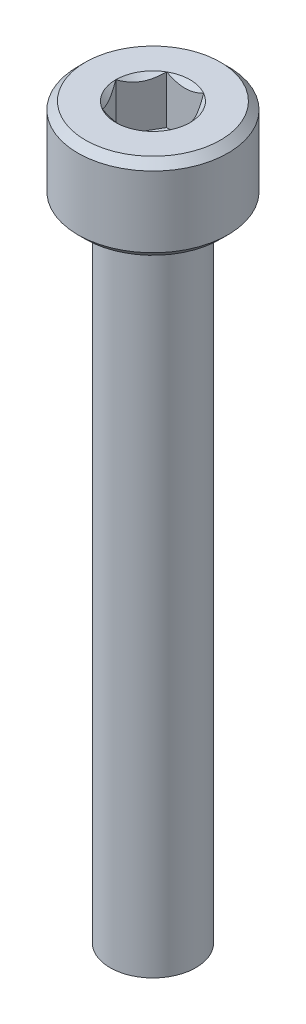
ISO-10303-21;
HEADER;
FILE_DESCRIPTION(('STEP AP214'),'2;1');
FILE_NAME('part.step','',(''),(''),'','','');
FILE_SCHEMA(('AUTOMOTIVE_DESIGN { 1 0 10303 214 1 1 1 1 }'));
ENDSEC;
DATA;
#1=APPLICATION_CONTEXT('core data for automotive mechanical design processes');
#2=APPLICATION_PROTOCOL_DEFINITION('international standard','automotive_design',2000,#1);
#3=PRODUCT_CONTEXT('',#1,'mechanical');
#4=PRODUCT('Part','Part','',(#3));
#5=PRODUCT_RELATED_PRODUCT_CATEGORY('part','',(#4));
#6=PRODUCT_DEFINITION_FORMATION('','',#4);
#7=PRODUCT_DEFINITION_CONTEXT('part definition',#1,'design');
#8=PRODUCT_DEFINITION('design','',#6,#7);
#9=PRODUCT_DEFINITION_SHAPE('','',#8);
#10=(LENGTH_UNIT() NAMED_UNIT(*) SI_UNIT(.MILLI.,.METRE.));
#11=(NAMED_UNIT(*) PLANE_ANGLE_UNIT() SI_UNIT($,.RADIAN.));
#12=(NAMED_UNIT(*) SI_UNIT($,.STERADIAN.) SOLID_ANGLE_UNIT());
#13=UNCERTAINTY_MEASURE_WITH_UNIT(LENGTH_MEASURE(1.E-05),#10,'distance_accuracy_value','');
#14=(GEOMETRIC_REPRESENTATION_CONTEXT(3) GLOBAL_UNCERTAINTY_ASSIGNED_CONTEXT((#13)) GLOBAL_UNIT_ASSIGNED_CONTEXT((#10,
#11,#12)) REPRESENTATION_CONTEXT('',''));
#15=CARTESIAN_POINT('',(0.,0.,0.));
#16=DIRECTION('',(0.,0.,1.));
#17=DIRECTION('',(1.,0.,0.));
#18=AXIS2_PLACEMENT_3D('',#15,#16,#17);
#19=CARTESIAN_POINT('',(0.,4.,0.));
#20=DIRECTION('',(0.,-1.,0.));
#21=DIRECTION('',(0.,0.,-1.));
#22=AXIS2_PLACEMENT_3D('',#19,#20,#21);
#23=CYLINDRICAL_SURFACE('',#22,3.5);
#24=CARTESIAN_POINT('',(0.,0.350000000000001,0.));
#25=DIRECTION('',(0.,1.,0.));
#26=DIRECTION('',(0.,0.,1.));
#27=AXIS2_PLACEMENT_3D('',#24,#25,#26);
#28=CIRCLE('',#27,3.5);
#29=CARTESIAN_POINT('',(0.,0.350000000000001,3.5));
#30=VERTEX_POINT('',#29);
#31=EDGE_CURVE('E227',#30,#30,#28,.T.);
#32=ORIENTED_EDGE('',*,*,#31,.T.);
#33=EDGE_LOOP('',(#32));
#34=FACE_BOUND('',#33,.T.);
#35=CARTESIAN_POINT('',(0.,3.65,0.));
#36=DIRECTION('',(0.,1.,0.));
#37=DIRECTION('',(0.,0.,1.));
#38=AXIS2_PLACEMENT_3D('',#35,#36,#37);
#39=CIRCLE('',#38,3.5);
#40=CARTESIAN_POINT('',(0.,3.65,3.5));
#41=VERTEX_POINT('',#40);
#42=EDGE_CURVE('E104',#41,#41,#39,.F.);
#43=ORIENTED_EDGE('',*,*,#42,.T.);
#44=EDGE_LOOP('',(#43));
#45=FACE_BOUND('',#44,.T.);
#46=ADVANCED_FACE('F32',(#34,#45),#23,.T.);
#47=CARTESIAN_POINT('',(0.,4.,0.));
#48=DIRECTION('',(0.,1.,0.));
#49=DIRECTION('',(0.,0.,1.));
#50=AXIS2_PLACEMENT_3D('',#47,#48,#49);
#51=PLANE('',#50);
#52=CARTESIAN_POINT('',(0.,4.,0.));
#53=DIRECTION('',(0.,1.,0.));
#54=DIRECTION('',(0.,0.,1.));
#55=AXIS2_PLACEMENT_3D('',#52,#53,#54);
#56=CIRCLE('',#55,3.15);
#57=CARTESIAN_POINT('',(0.,4.,3.15));
#58=VERTEX_POINT('',#57);
#59=EDGE_CURVE('E36',#58,#58,#56,.T.);
#60=ORIENTED_EDGE('',*,*,#59,.T.);
#61=EDGE_LOOP('',(#60));
#62=FACE_BOUND('',#61,.T.);
#63=CARTESIAN_POINT('',(0.,4.,0.));
#64=DIRECTION('',(0.,1.,0.));
#65=DIRECTION('',(0.,0.,1.));
#66=AXIS2_PLACEMENT_3D('',#63,#64,#65);
#67=CIRCLE('',#66,1.73205080756888);
#68=CARTESIAN_POINT('',(0.866025403784438,4.,1.5));
#69=VERTEX_POINT('',#68);
#70=CARTESIAN_POINT('',(1.73205080756888,4.,0.));
#71=VERTEX_POINT('',#70);
#72=EDGE_CURVE('E47',#69,#71,#67,.T.);
#73=ORIENTED_EDGE('',*,*,#72,.F.);
#74=CARTESIAN_POINT('',(-0.866025403784438,4.,1.5));
#75=VERTEX_POINT('',#74);
#76=EDGE_CURVE('E54',#75,#69,#67,.T.);
#77=ORIENTED_EDGE('',*,*,#76,.F.);
#78=CARTESIAN_POINT('',(-1.73205080756888,4.,0.));
#79=VERTEX_POINT('',#78);
#80=EDGE_CURVE('E127',#79,#75,#67,.T.);
#81=ORIENTED_EDGE('',*,*,#80,.F.);
#82=CARTESIAN_POINT('',(-0.866025403784439,4.,-1.5));
#83=VERTEX_POINT('',#82);
#84=EDGE_CURVE('E126',#83,#79,#67,.T.);
#85=ORIENTED_EDGE('',*,*,#84,.F.);
#86=CARTESIAN_POINT('',(0.866025403784438,4.,-1.5));
#87=VERTEX_POINT('',#86);
#88=EDGE_CURVE('E94',#87,#83,#67,.T.);
#89=ORIENTED_EDGE('',*,*,#88,.F.);
#90=EDGE_CURVE('E86',#71,#87,#67,.T.);
#91=ORIENTED_EDGE('',*,*,#90,.F.);
#92=EDGE_LOOP('',(#73,#77,#81,#85,#89,#91));
#93=FACE_BOUND('',#92,.T.);
#94=ADVANCED_FACE('F124',(#62,#93),#51,.T.);
#95=CARTESIAN_POINT('',(0.,0.,0.));
#96=DIRECTION('',(0.,1.,0.));
#97=DIRECTION('',(0.,0.,1.));
#98=AXIS2_PLACEMENT_3D('',#95,#96,#97);
#99=PLANE('',#98);
#100=CARTESIAN_POINT('',(0.,0.,0.));
#101=DIRECTION('',(0.,-1.,0.));
#102=DIRECTION('',(0.,0.,-1.));
#103=AXIS2_PLACEMENT_3D('',#100,#101,#102);
#104=CIRCLE('',#103,2.);
#105=CARTESIAN_POINT('',(0.,0.,-2.));
#106=VERTEX_POINT('',#105);
#107=EDGE_CURVE('E11',#106,#106,#104,.T.);
#108=ORIENTED_EDGE('',*,*,#107,.F.);
#109=EDGE_LOOP('',(#108));
#110=FACE_BOUND('',#109,.T.);
#111=CARTESIAN_POINT('',(0.,0.,0.));
#112=DIRECTION('',(0.,1.,0.));
#113=DIRECTION('',(0.,0.,1.));
#114=AXIS2_PLACEMENT_3D('',#111,#112,#113);
#115=CIRCLE('',#114,3.15);
#116=CARTESIAN_POINT('',(0.,0.,3.15));
#117=VERTEX_POINT('',#116);
#118=EDGE_CURVE('E225',#117,#117,#115,.F.);
#119=ORIENTED_EDGE('',*,*,#118,.T.);
#120=EDGE_LOOP('',(#119));
#121=FACE_BOUND('',#120,.T.);
#122=ADVANCED_FACE('F208',(#110,#121),#99,.F.);
#123=CARTESIAN_POINT('',(0.,4.,0.));
#124=DIRECTION('',(0.,1.,0.));
#125=DIRECTION('',(0.,0.,1.));
#126=AXIS2_PLACEMENT_3D('',#123,#124,#125);
#127=CONICAL_SURFACE('',#126,1.73205080756888,0.78539816339745);
#128=ORIENTED_EDGE('',*,*,#88,.T.);
#129=CARTESIAN_POINT('',(-1.72720812969692,4.55557851627079,-1.5));
#130=CARTESIAN_POINT('',(-1.68515175699268,4.52382990785743,-1.5));
#131=CARTESIAN_POINT('',(-1.64286104748673,4.49239259380738,-1.5));
#132=CARTESIAN_POINT('',(-1.55771581035942,4.43026908755641,-1.5));
#133=CARTESIAN_POINT('',(-1.51486114386668,4.3995830858922,-1.5));
#134=CARTESIAN_POINT('',(-1.3846813415127,4.30840719242716,-1.5));
#135=CARTESIAN_POINT('',(-1.29637976071654,4.24928834342677,-1.5));
#136=CARTESIAN_POINT('',(-1.11121478730467,4.1332309963165,-1.5));
#137=CARTESIAN_POINT('',(-1.01415038238167,4.07660955873301,-1.5));
#138=CARTESIAN_POINT('',(-0.815173408897606,3.97303688126565,-1.5));
#139=CARTESIAN_POINT('',(-0.713278669253285,3.92605304154167,-1.5));
#140=CARTESIAN_POINT('',(-0.560333774943112,3.86857266843083,-1.5));
#141=CARTESIAN_POINT('',(-0.511547982948042,3.85207538775725,-1.5));
#142=CARTESIAN_POINT('',(-0.412798620136866,3.822997512927,-1.5));
#143=CARTESIAN_POINT('',(-0.362834968437563,3.81041718859402,-1.5));
#144=CARTESIAN_POINT('',(-0.262863235444982,3.79003619414677,-1.5));
#145=CARTESIAN_POINT('',(-0.212872113808023,3.78215363274598,-1.5));
#146=CARTESIAN_POINT('',(-0.112355243569545,3.771322063969,-1.5));
#147=CARTESIAN_POINT('',(-0.0618295883726279,3.76837220852435,-1.5));
#148=CARTESIAN_POINT('',(0.037429173332384,3.76762485772485,-1.5));
#149=CARTESIAN_POINT('',(0.0861609672002989,3.76964473355808,-1.5));
#150=CARTESIAN_POINT('',(0.183206937768827,3.77832255289676,-1.5));
#151=CARTESIAN_POINT('',(0.231521073438269,3.78498094696846,-1.5));
#152=CARTESIAN_POINT('',(0.328199853425436,3.80268524412257,-1.5));
#153=CARTESIAN_POINT('',(0.376550616310328,3.81380581125704,-1.5));
#154=CARTESIAN_POINT('',(0.472195697125598,3.83984341404871,-1.5));
#155=CARTESIAN_POINT('',(0.51949010309274,3.85476013204094,-1.5));
#156=CARTESIAN_POINT('',(0.668391282696624,3.90733522359607,-1.5));
#157=CARTESIAN_POINT('',(0.767878709508552,3.95098128747198,-1.5));
#158=CARTESIAN_POINT('',(0.962179866690724,4.0480229945931,-1.5));
#159=CARTESIAN_POINT('',(1.05697519961444,4.10145366508953,-1.5));
#160=CARTESIAN_POINT('',(1.23814273533383,4.21168585200456,-1.5));
#161=CARTESIAN_POINT('',(1.3246994218129,4.2681879206986,-1.5));
#162=CARTESIAN_POINT('',(1.45222331290673,4.35553430157866,-1.5));
#163=CARTESIAN_POINT('',(1.49418091978756,4.38495775868004,-1.5));
#164=CARTESIAN_POINT('',(1.57752272931476,4.44458282183046,-1.5));
#165=CARTESIAN_POINT('',(1.61890708647354,4.47478421166444,-1.5));
#166=CARTESIAN_POINT('',(1.66005278019494,4.50530817860946,-1.5));
#167=B_SPLINE_CURVE_WITH_KNOTS('',3,(#129,#130,#131,#132,#133,#134,#135,#136,#137,#138,#139,
#140,#141,#142,#143,#144,#145,#146,#147,#148,#149,#150,#151,#152,#153,#154,#155,#156,#157,#158,
#159,#160,#161,#162,#163,#164,#165,#166),.UNSPECIFIED.,.F.,.F.,(4,2,2,2,2,2,2,2,2,2,2,2,2,2,2,2,
2,2,4),(0.,0.158079548982669,0.316198780993942,0.634850417346958,0.971690311361509,
1.30737131660667,1.46173961127089,1.61611853740677,1.76772101421409,1.91929742368538,
2.065387412096,2.21149159305544,2.36014984633872,2.50879566386709,2.83376031422673,
3.15991186985652,3.46985601802197,3.62358896039974,3.7772796264207),.UNSPECIFIED.);
#168=EDGE_CURVE('E99',#87,#83,#167,.F.);
#169=ORIENTED_EDGE('',*,*,#168,.F.);
#170=EDGE_LOOP('',(#128,#169));
#171=FACE_BOUND('',#170,.T.);
#172=ADVANCED_FACE('F100',(#171),#127,.F.);
#173=ORIENTED_EDGE('',*,*,#84,.T.);
#174=CARTESIAN_POINT('',(-0.865909933730601,4.00011548160007,-1.5002));
#175=CARTESIAN_POINT('',(-0.895682611594166,3.97036547606733,-1.44863220926292));
#176=CARTESIAN_POINT('',(-0.925953159489765,3.94236248391031,-1.3962020823348));
#177=CARTESIAN_POINT('',(-0.987678321317123,3.89108923044014,-1.2892909659444));
#178=CARTESIAN_POINT('',(-1.01913880822717,3.86784750504437,-1.23479980418534));
#179=CARTESIAN_POINT('',(-1.08257741237344,3.82803372899222,-1.12492091864275));
#180=CARTESIAN_POINT('',(-1.11453936608521,3.8113615856709,-1.0695611909048));
#181=CARTESIAN_POINT('',(-1.1791670593912,3.7856744568181,-0.957622742522849));
#182=CARTESIAN_POINT('',(-1.21183082354213,3.77664029047887,-0.901047443446992));
#183=CARTESIAN_POINT('',(-1.26812411040032,3.76848908122685,-0.803544610483559));
#184=CARTESIAN_POINT('',(-1.29168087824208,3.76728225298922,-0.762743091719534));
#185=CARTESIAN_POINT('',(-1.33875285845138,3.76931405716227,-0.681212030384142));
#186=CARTESIAN_POINT('',(-1.36226806050018,3.77255367074831,-0.64048250568537));
#187=CARTESIAN_POINT('',(-1.40907206156905,3.78329198598196,-0.559415597836584));
#188=CARTESIAN_POINT('',(-1.43236062923612,3.79079465301873,-0.519078615401712));
#189=CARTESIAN_POINT('',(-1.47854689118996,3.80965161192829,-0.439081663085969));
#190=CARTESIAN_POINT('',(-1.50144441326545,3.82100755701858,-0.399421991483792));
#191=CARTESIAN_POINT('',(-1.56009461325633,3.85472164759267,-0.297836865225515));
#192=CARTESIAN_POINT('',(-1.59548353987866,3.87962184909337,-0.236541446290311));
#193=CARTESIAN_POINT('',(-1.64751843074894,3.92165665327158,-0.146414371536686));
#194=CARTESIAN_POINT('',(-1.66466545167617,3.9364251535591,-0.116714860092282));
#195=CARTESIAN_POINT('',(-1.69864410935691,3.96731056594017,-0.0578620986162487));
#196=CARTESIAN_POINT('',(-1.71547589206761,3.98342683412171,-0.0287085957793624));
#197=CARTESIAN_POINT('',(-1.73216627762272,4.00011548160007,0.00020000000000028));
#198=B_SPLINE_CURVE_WITH_KNOTS('',3,(#174,#175,#176,#177,#178,#179,#180,#181,#182,#183,#184,
#185,#186,#187,#188,#189,#190,#191,#192,#193,#194,#195,#196,#197),.UNSPECIFIED.,.F.,.F.,(4,2,2,
2,2,2,2,2,2,2,2,4),(0.,0.199829143693304,0.400822987382388,0.598623720538181,0.795926240188889,
0.937113067959881,1.07833105577193,1.21968061668222,1.36109089931054,1.58570969637565,
1.69770705470964,1.80965120737194),.UNSPECIFIED.);
#199=EDGE_CURVE('E129',#83,#79,#198,.T.);
#200=ORIENTED_EDGE('',*,*,#199,.F.);
#201=EDGE_LOOP('',(#173,#200));
#202=FACE_BOUND('',#201,.T.);
#203=ADVANCED_FACE('F240',(#202),#127,.F.);
#204=ORIENTED_EDGE('',*,*,#80,.T.);
#205=CARTESIAN_POINT('',(-1.73216627762272,4.00011548160007,-0.000199999999999694));
#206=CARTESIAN_POINT('',(-1.70239359975915,3.97036547606733,0.051367790737076));
#207=CARTESIAN_POINT('',(-1.67212305186355,3.94236248391031,0.103797917665201));
#208=CARTESIAN_POINT('',(-1.61039789003619,3.89108923044014,0.210709034055597));
#209=CARTESIAN_POINT('',(-1.57893740312614,3.86784750504437,0.265200195814662));
#210=CARTESIAN_POINT('',(-1.51549879897987,3.82803372899222,0.375079081357249));
#211=CARTESIAN_POINT('',(-1.4835368452681,3.8113615856709,0.4304388090952));
#212=CARTESIAN_POINT('',(-1.41890915196211,3.7856744568181,0.542377257477151));
#213=CARTESIAN_POINT('',(-1.38624538781118,3.77664029047887,0.598952556553009));
#214=CARTESIAN_POINT('',(-1.32995210095299,3.76848908122685,0.696455389516441));
#215=CARTESIAN_POINT('',(-1.30639533311124,3.76728225298922,0.737256908280466));
#216=CARTESIAN_POINT('',(-1.25932335290193,3.76931405716227,0.818787969615858));
#217=CARTESIAN_POINT('',(-1.23580815085313,3.77255367074831,0.85951749431463));
#218=CARTESIAN_POINT('',(-1.18900414978427,3.78329198598196,0.940584402163416));
#219=CARTESIAN_POINT('',(-1.1657155821172,3.79079465301873,0.980921384598288));
#220=CARTESIAN_POINT('',(-1.11952932016335,3.80965161192829,1.06091833691403));
#221=CARTESIAN_POINT('',(-1.09663179808786,3.82100755701859,1.10057800851621));
#222=CARTESIAN_POINT('',(-1.03798159809698,3.85472164759267,1.20216313477448));
#223=CARTESIAN_POINT('',(-1.00259267147465,3.87962184909337,1.26345855370969));
#224=CARTESIAN_POINT('',(-0.950557780604375,3.92165665327158,1.35358562846331));
#225=CARTESIAN_POINT('',(-0.933410759677147,3.9364251535591,1.38328513990772));
#226=CARTESIAN_POINT('',(-0.899432101996407,3.96731056594017,1.44213790138375));
#227=CARTESIAN_POINT('',(-0.88260031928571,3.98342683412171,1.47129140422064));
#228=CARTESIAN_POINT('',(-0.865909933730601,4.00011548160007,1.5002));
#229=B_SPLINE_CURVE_WITH_KNOTS('',3,(#205,#206,#207,#208,#209,#210,#211,#212,#213,#214,#215,
#216,#217,#218,#219,#220,#221,#222,#223,#224,#225,#226,#227,#228),.UNSPECIFIED.,.F.,.F.,(4,2,2,
2,2,2,2,2,2,2,2,4),(0.,0.199829143693305,0.400822987382389,0.598623720538181,0.795926240188889,
0.937113067959881,1.07833105577193,1.21968061668222,1.36109089931054,1.58570969637565,
1.69770705470964,1.80965120737194),.UNSPECIFIED.);
#230=EDGE_CURVE('E139',#79,#75,#229,.T.);
#231=ORIENTED_EDGE('',*,*,#230,.F.);
#232=EDGE_LOOP('',(#204,#231));
#233=FACE_BOUND('',#232,.T.);
#234=ADVANCED_FACE('F256',(#233),#127,.F.);
#235=ORIENTED_EDGE('',*,*,#76,.T.);
#236=CARTESIAN_POINT('',(-1.72720812994822,4.55557851646053,1.5));
#237=CARTESIAN_POINT('',(-1.68515175723693,4.52382990803985,1.5));
#238=CARTESIAN_POINT('',(-1.64286104772391,4.49239259398251,1.5));
#239=CARTESIAN_POINT('',(-1.55771581058238,4.43026908771699,1.5));
#240=CARTESIAN_POINT('',(-1.51486114408249,4.39958308604553,1.5));
#241=CARTESIAN_POINT('',(-1.38468134170665,4.30840719255859,1.5));
#242=CARTESIAN_POINT('',(-1.29637976089561,4.24928834354366,1.5));
#243=CARTESIAN_POINT('',(-1.11121478745132,4.13323099640349,1.5));
#244=CARTESIAN_POINT('',(-1.01415038251067,4.07660955880473,1.5));
#245=CARTESIAN_POINT('',(-0.815173408989814,3.9730368813091,1.5));
#246=CARTESIAN_POINT('',(-0.71327866932636,3.92605304157206,1.5));
#247=CARTESIAN_POINT('',(-0.56033377500179,3.86857266845154,1.5));
#248=CARTESIAN_POINT('',(-0.511547983012749,3.85207538777834,1.5));
#249=CARTESIAN_POINT('',(-0.412798620213828,3.82299751294763,1.5));
#250=CARTESIAN_POINT('',(-0.362834968520751,3.8104171886138,1.5));
#251=CARTESIAN_POINT('',(-0.262863235540417,3.79003619416346,1.5));
#252=CARTESIAN_POINT('',(-0.212872113909475,3.78215363276045,1.5));
#253=CARTESIAN_POINT('',(-0.112355243682832,3.77132206397768,1.5));
#254=CARTESIAN_POINT('',(-0.061829588491731,3.76837220852945,1.5));
#255=CARTESIAN_POINT('',(0.0374291732025493,3.76762485772178,1.5));
#256=CARTESIAN_POINT('',(0.086160967065534,3.76964473355048,1.5));
#257=CARTESIAN_POINT('',(0.183206937624695,3.77832255287941,1.5));
#258=CARTESIAN_POINT('',(0.2315210732897,3.78498094694588,1.5));
#259=CARTESIAN_POINT('',(0.328199853268108,3.80268524408904,1.5));
#260=CARTESIAN_POINT('',(0.376550616148692,3.81380581121775,1.5));
#261=CARTESIAN_POINT('',(0.47219569695576,3.83984341399777,1.5));
#262=CARTESIAN_POINT('',(0.51949010291901,3.8547601319841,1.5));
#263=CARTESIAN_POINT('',(0.668391282485064,3.90733522351148,1.5));
#264=CARTESIAN_POINT('',(0.767878709264951,3.95098128736184,1.5));
#265=CARTESIAN_POINT('',(0.9621798663855,4.04802299442906,1.5));
#266=CARTESIAN_POINT('',(1.05697519927965,4.10145366489712,1.5));
#267=CARTESIAN_POINT('',(1.23814273494588,4.21168585175783,1.5));
#268=CARTESIAN_POINT('',(1.32469942140117,4.26818792042618,1.5));
#269=CARTESIAN_POINT('',(1.45222331245985,4.35553430126784,1.5));
#270=CARTESIAN_POINT('',(1.49418091932912,4.38495775835653,1.5));
#271=CARTESIAN_POINT('',(1.5775227288333,4.44458282148157,1.5));
#272=CARTESIAN_POINT('',(1.6189070859806,4.47478421130286,1.5));
#273=CARTESIAN_POINT('',(1.66005277969054,4.50530817823521,1.5));
#274=B_SPLINE_CURVE_WITH_KNOTS('',3,(#236,#237,#238,#239,#240,#241,#242,#243,#244,#245,#246,
#247,#248,#249,#250,#251,#252,#253,#254,#255,#256,#257,#258,#259,#260,#261,#262,#263,#264,#265,
#266,#267,#268,#269,#270,#271,#272,#273),.UNSPECIFIED.,.F.,.F.,(4,2,2,2,2,2,2,2,2,2,2,2,2,2,2,2,
2,2,4),(0.,0.158079549012757,0.316198781054129,0.634850417468465,0.971690311551782,
1.30737131686505,1.46173961151184,1.61611853763032,1.76772101442095,1.91929742387554,
2.06538741227089,2.21149159321503,2.36014984648185,2.50879566399376,2.83376031423511,
3.15991186974582,3.4698560178094,3.62358896013692,3.77727962610764),.UNSPECIFIED.);
#275=EDGE_CURVE('E168',#75,#69,#274,.T.);
#276=ORIENTED_EDGE('',*,*,#275,.F.);
#277=EDGE_LOOP('',(#235,#276));
#278=FACE_BOUND('',#277,.T.);
#279=ADVANCED_FACE('F286',(#278),#127,.F.);
#280=ORIENTED_EDGE('',*,*,#72,.T.);
#281=CARTESIAN_POINT('',(0.865909933730601,4.00011548160007,1.5002));
#282=CARTESIAN_POINT('',(0.895682611594166,3.97036547606733,1.44863220926292));
#283=CARTESIAN_POINT('',(0.925953159489765,3.94236248391031,1.3962020823348));
#284=CARTESIAN_POINT('',(0.987678321317124,3.89108923044014,1.2892909659444));
#285=CARTESIAN_POINT('',(1.01913880822717,3.86784750504437,1.23479980418534));
#286=CARTESIAN_POINT('',(1.08257741237344,3.82803372899222,1.12492091864275));
#287=CARTESIAN_POINT('',(1.11453936608521,3.8113615856709,1.0695611909048));
#288=CARTESIAN_POINT('',(1.1791670593912,3.7856744568181,0.95762274252285));
#289=CARTESIAN_POINT('',(1.21183082354213,3.77664029047887,0.901047443446992));
#290=CARTESIAN_POINT('',(1.26812411040032,3.76848908122685,0.80354461048356));
#291=CARTESIAN_POINT('',(1.29168087824208,3.76728225298922,0.762743091719534));
#292=CARTESIAN_POINT('',(1.33875285845138,3.76931405716227,0.681212030384142));
#293=CARTESIAN_POINT('',(1.36226806050018,3.77255367074831,0.640482505685371));
#294=CARTESIAN_POINT('',(1.40907206156905,3.78329198598196,0.559415597836584));
#295=CARTESIAN_POINT('',(1.43236062923612,3.79079465301873,0.519078615401712));
#296=CARTESIAN_POINT('',(1.47854689118996,3.80965161192829,0.43908166308597));
#297=CARTESIAN_POINT('',(1.50144441326545,3.82100755701859,0.399421991483792));
#298=CARTESIAN_POINT('',(1.56009461325633,3.85472164759267,0.297836865225515));
#299=CARTESIAN_POINT('',(1.59548353987866,3.87962184909337,0.236541446290311));
#300=CARTESIAN_POINT('',(1.64751843074894,3.92165665327158,0.146414371536686));
#301=CARTESIAN_POINT('',(1.66466545167617,3.9364251535591,0.116714860092282));
#302=CARTESIAN_POINT('',(1.69864410935691,3.96731056594017,0.0578620986162488));
#303=CARTESIAN_POINT('',(1.71547589206761,3.98342683412171,0.0287085957793626));
#304=CARTESIAN_POINT('',(1.73216627762272,4.00011548160007,-0.000200000000000026));
#305=B_SPLINE_CURVE_WITH_KNOTS('',3,(#281,#282,#283,#284,#285,#286,#287,#288,#289,#290,#291,
#292,#293,#294,#295,#296,#297,#298,#299,#300,#301,#302,#303,#304),.UNSPECIFIED.,.F.,.F.,(4,2,2,
2,2,2,2,2,2,2,2,4),(0.,0.199829143693305,0.400822987382389,0.59862372053818,0.795926240188889,
0.937113067959881,1.07833105577193,1.21968061668222,1.36109089931054,1.58570969637565,
1.69770705470964,1.80965120737194),.UNSPECIFIED.);
#306=EDGE_CURVE('E114',#69,#71,#305,.T.);
#307=ORIENTED_EDGE('',*,*,#306,.F.);
#308=EDGE_LOOP('',(#280,#307));
#309=FACE_BOUND('',#308,.T.);
#310=ADVANCED_FACE('F154',(#309),#127,.F.);
#311=ORIENTED_EDGE('',*,*,#90,.T.);
#312=CARTESIAN_POINT('',(1.73216627762272,4.00011548160007,0.000200000000000282));
#313=CARTESIAN_POINT('',(1.70239359975915,3.97036547606733,-0.0513677907370753));
#314=CARTESIAN_POINT('',(1.67212305186355,3.94236248391031,-0.103797917665201));
#315=CARTESIAN_POINT('',(1.61039789003619,3.89108923044014,-0.210709034055596));
#316=CARTESIAN_POINT('',(1.57893740312614,3.86784750504437,-0.265200195814661));
#317=CARTESIAN_POINT('',(1.51549879897987,3.82803372899222,-0.375079081357248));
#318=CARTESIAN_POINT('',(1.4835368452681,3.8113615856709,-0.430438809095199));
#319=CARTESIAN_POINT('',(1.41890915196211,3.7856744568181,-0.54237725747715));
#320=CARTESIAN_POINT('',(1.38624538781118,3.77664029047887,-0.598952556553008));
#321=CARTESIAN_POINT('',(1.32995210095299,3.76848908122685,-0.69645538951644));
#322=CARTESIAN_POINT('',(1.30639533311124,3.76728225298922,-0.737256908280466));
#323=CARTESIAN_POINT('',(1.25932335290193,3.76931405716227,-0.818787969615858));
#324=CARTESIAN_POINT('',(1.23580815085313,3.77255367074831,-0.85951749431463));
#325=CARTESIAN_POINT('',(1.18900414978427,3.78329198598196,-0.940584402163416));
#326=CARTESIAN_POINT('',(1.1657155821172,3.79079465301873,-0.980921384598288));
#327=CARTESIAN_POINT('',(1.11952932016335,3.80965161192829,-1.06091833691403));
#328=CARTESIAN_POINT('',(1.09663179808786,3.82100755701858,-1.10057800851621));
#329=CARTESIAN_POINT('',(1.03798159809698,3.85472164759267,-1.20216313477448));
#330=CARTESIAN_POINT('',(1.00259267147465,3.87962184909337,-1.26345855370969));
#331=CARTESIAN_POINT('',(0.950557780604375,3.92165665327158,-1.35358562846331));
#332=CARTESIAN_POINT('',(0.933410759677148,3.9364251535591,-1.38328513990772));
#333=CARTESIAN_POINT('',(0.899432101996407,3.96731056594017,-1.44213790138375));
#334=CARTESIAN_POINT('',(0.88260031928571,3.98342683412171,-1.47129140422064));
#335=CARTESIAN_POINT('',(0.865909933730601,4.00011548160007,-1.5002));
#336=B_SPLINE_CURVE_WITH_KNOTS('',3,(#312,#313,#314,#315,#316,#317,#318,#319,#320,#321,#322,
#323,#324,#325,#326,#327,#328,#329,#330,#331,#332,#333,#334,#335),.UNSPECIFIED.,.F.,.F.,(4,2,2,
2,2,2,2,2,2,2,2,4),(0.,0.199829143693305,0.400822987382389,0.598623720538181,0.79592624018889,
0.937113067959881,1.07833105577193,1.21968061668222,1.36109089931054,1.58570969637566,
1.69770705470964,1.80965120737194),.UNSPECIFIED.);
#337=EDGE_CURVE('E90',#71,#87,#336,.T.);
#338=ORIENTED_EDGE('',*,*,#337,.F.);
#339=EDGE_LOOP('',(#311,#338));
#340=FACE_BOUND('',#339,.T.);
#341=ADVANCED_FACE('F88',(#340),#127,.F.);
#342=CARTESIAN_POINT('',(0.,1.75,0.));
#343=DIRECTION('',(0.,1.,0.));
#344=DIRECTION('',(0.,0.,1.));
#345=AXIS2_PLACEMENT_3D('',#342,#343,#344);
#346=PLANE('',#345);
#347=DIRECTION('',(-0.5,0.,-0.866025403784439));
#348=VECTOR('',#347,1.);
#349=CARTESIAN_POINT('',(1.73205080756888,1.75,0.));
#350=LINE('',#349,#348);
#351=CARTESIAN_POINT('',(1.73205080756888,1.75,0.));
#352=VERTEX_POINT('',#351);
#353=CARTESIAN_POINT('',(0.866025403784438,1.75,-1.5));
#354=VERTEX_POINT('',#353);
#355=EDGE_CURVE('E113',#352,#354,#350,.T.);
#356=ORIENTED_EDGE('',*,*,#355,.T.);
#357=DIRECTION('',(-1.,0.,0.));
#358=VECTOR('',#357,1.);
#359=CARTESIAN_POINT('',(0.866025403784438,1.75,-1.5));
#360=LINE('',#359,#358);
#361=CARTESIAN_POINT('',(-0.866025403784439,1.75,-1.5));
#362=VERTEX_POINT('',#361);
#363=EDGE_CURVE('E118',#354,#362,#360,.T.);
#364=ORIENTED_EDGE('',*,*,#363,.T.);
#365=DIRECTION('',(-0.5,0.,0.866025403784439));
#366=VECTOR('',#365,1.);
#367=CARTESIAN_POINT('',(-0.866025403784439,1.75,-1.5));
#368=LINE('',#367,#366);
#369=CARTESIAN_POINT('',(-1.73205080756888,1.75,0.));
#370=VERTEX_POINT('',#369);
#371=EDGE_CURVE('E280',#362,#370,#368,.T.);
#372=ORIENTED_EDGE('',*,*,#371,.T.);
#373=DIRECTION('',(0.5,0.,0.866025403784439));
#374=VECTOR('',#373,1.);
#375=CARTESIAN_POINT('',(-1.73205080756888,1.75,0.));
#376=LINE('',#375,#374);
#377=CARTESIAN_POINT('',(-0.866025403784438,1.75,1.5));
#378=VERTEX_POINT('',#377);
#379=EDGE_CURVE('E263',#370,#378,#376,.T.);
#380=ORIENTED_EDGE('',*,*,#379,.T.);
#381=DIRECTION('',(1.,0.,0.));
#382=VECTOR('',#381,1.);
#383=CARTESIAN_POINT('',(-0.866025403784438,1.75,1.5));
#384=LINE('',#383,#382);
#385=CARTESIAN_POINT('',(0.866025403784439,1.75,1.5));
#386=VERTEX_POINT('',#385);
#387=EDGE_CURVE('E276',#378,#386,#384,.T.);
#388=ORIENTED_EDGE('',*,*,#387,.T.);
#389=DIRECTION('',(0.5,0.,-0.866025403784439));
#390=VECTOR('',#389,1.);
#391=CARTESIAN_POINT('',(0.866025403784439,1.75,1.5));
#392=LINE('',#391,#390);
#393=EDGE_CURVE('E121',#386,#352,#392,.T.);
#394=ORIENTED_EDGE('',*,*,#393,.T.);
#395=EDGE_LOOP('',(#356,#364,#372,#380,#388,#394));
#396=FACE_BOUND('',#395,.T.);
#397=ADVANCED_FACE('F153',(#396),#346,.T.);
#398=CARTESIAN_POINT('',(0.866025403784438,1.75,-1.5));
#399=DIRECTION('',(0.,0.,-1.));
#400=DIRECTION('',(-1.,0.,0.));
#401=AXIS2_PLACEMENT_3D('',#398,#399,#400);
#402=PLANE('',#401);
#403=DIRECTION('',(0.,1.,0.));
#404=VECTOR('',#403,1.);
#405=CARTESIAN_POINT('',(0.866025403784438,1.75,-1.5));
#406=LINE('',#405,#404);
#407=EDGE_CURVE('E111',#354,#87,#406,.T.);
#408=ORIENTED_EDGE('',*,*,#407,.T.);
#409=ORIENTED_EDGE('',*,*,#168,.T.);
#410=DIRECTION('',(0.,1.,0.));
#411=VECTOR('',#410,1.);
#412=CARTESIAN_POINT('',(-0.866025403784439,1.75,-1.5));
#413=LINE('',#412,#411);
#414=EDGE_CURVE('E120',#362,#83,#413,.T.);
#415=ORIENTED_EDGE('',*,*,#414,.F.);
#416=ORIENTED_EDGE('',*,*,#363,.F.);
#417=EDGE_LOOP('',(#408,#409,#415,#416));
#418=FACE_BOUND('',#417,.T.);
#419=ADVANCED_FACE('F116',(#418),#402,.F.);
#420=CARTESIAN_POINT('',(-0.866025403784439,1.75,-1.5));
#421=DIRECTION('',(-0.866025403784439,0.,-0.5));
#422=DIRECTION('',(-0.5,0.,0.866025403784439));
#423=AXIS2_PLACEMENT_3D('',#420,#421,#422);
#424=PLANE('',#423);
#425=ORIENTED_EDGE('',*,*,#414,.T.);
#426=ORIENTED_EDGE('',*,*,#199,.T.);
#427=DIRECTION('',(0.,1.,0.));
#428=VECTOR('',#427,1.);
#429=CARTESIAN_POINT('',(-1.73205080756888,1.75,0.));
#430=LINE('',#429,#428);
#431=EDGE_CURVE('E259',#370,#79,#430,.T.);
#432=ORIENTED_EDGE('',*,*,#431,.F.);
#433=ORIENTED_EDGE('',*,*,#371,.F.);
#434=EDGE_LOOP('',(#425,#426,#432,#433));
#435=FACE_BOUND('',#434,.T.);
#436=ADVANCED_FACE('F146',(#435),#424,.F.);
#437=CARTESIAN_POINT('',(-1.73205080756888,1.75,0.));
#438=DIRECTION('',(-0.866025403784439,0.,0.5));
#439=DIRECTION('',(0.5,0.,0.866025403784439));
#440=AXIS2_PLACEMENT_3D('',#437,#438,#439);
#441=PLANE('',#440);
#442=ORIENTED_EDGE('',*,*,#431,.T.);
#443=ORIENTED_EDGE('',*,*,#230,.T.);
#444=DIRECTION('',(0.,1.,0.));
#445=VECTOR('',#444,1.);
#446=CARTESIAN_POINT('',(-0.866025403784438,1.75,1.5));
#447=LINE('',#446,#445);
#448=EDGE_CURVE('E265',#378,#75,#447,.T.);
#449=ORIENTED_EDGE('',*,*,#448,.F.);
#450=ORIENTED_EDGE('',*,*,#379,.F.);
#451=EDGE_LOOP('',(#442,#443,#449,#450));
#452=FACE_BOUND('',#451,.T.);
#453=ADVANCED_FACE('F192',(#452),#441,.F.);
#454=CARTESIAN_POINT('',(-0.866025403784438,1.75,1.5));
#455=DIRECTION('',(0.,0.,1.));
#456=DIRECTION('',(1.,0.,0.));
#457=AXIS2_PLACEMENT_3D('',#454,#455,#456);
#458=PLANE('',#457);
#459=ORIENTED_EDGE('',*,*,#448,.T.);
#460=ORIENTED_EDGE('',*,*,#275,.T.);
#461=DIRECTION('',(0.,1.,0.));
#462=VECTOR('',#461,1.);
#463=CARTESIAN_POINT('',(0.866025403784439,1.75,1.5));
#464=LINE('',#463,#462);
#465=EDGE_CURVE('E267',#386,#69,#464,.T.);
#466=ORIENTED_EDGE('',*,*,#465,.F.);
#467=ORIENTED_EDGE('',*,*,#387,.F.);
#468=EDGE_LOOP('',(#459,#460,#466,#467));
#469=FACE_BOUND('',#468,.T.);
#470=ADVANCED_FACE('F188',(#469),#458,.F.);
#471=CARTESIAN_POINT('',(0.866025403784439,1.75,1.5));
#472=DIRECTION('',(0.866025403784439,0.,0.5));
#473=DIRECTION('',(0.5,0.,-0.866025403784439));
#474=AXIS2_PLACEMENT_3D('',#471,#472,#473);
#475=PLANE('',#474);
#476=ORIENTED_EDGE('',*,*,#465,.T.);
#477=ORIENTED_EDGE('',*,*,#306,.T.);
#478=DIRECTION('',(0.,1.,0.));
#479=VECTOR('',#478,1.);
#480=CARTESIAN_POINT('',(1.73205080756888,1.75,0.));
#481=LINE('',#480,#479);
#482=EDGE_CURVE('E105',#352,#71,#481,.T.);
#483=ORIENTED_EDGE('',*,*,#482,.F.);
#484=ORIENTED_EDGE('',*,*,#393,.F.);
#485=EDGE_LOOP('',(#476,#477,#483,#484));
#486=FACE_BOUND('',#485,.T.);
#487=ADVANCED_FACE('F185',(#486),#475,.F.);
#488=CARTESIAN_POINT('',(1.73205080756888,1.75,0.));
#489=DIRECTION('',(0.866025403784439,0.,-0.5));
#490=DIRECTION('',(-0.5,0.,-0.866025403784439));
#491=AXIS2_PLACEMENT_3D('',#488,#489,#490);
#492=PLANE('',#491);
#493=ORIENTED_EDGE('',*,*,#482,.T.);
#494=ORIENTED_EDGE('',*,*,#337,.T.);
#495=ORIENTED_EDGE('',*,*,#407,.F.);
#496=ORIENTED_EDGE('',*,*,#355,.F.);
#497=EDGE_LOOP('',(#493,#494,#495,#496));
#498=FACE_BOUND('',#497,.T.);
#499=ADVANCED_FACE('F109',(#498),#492,.F.);
#500=CARTESIAN_POINT('',(0.,0.350000000000001,0.));
#501=DIRECTION('',(0.,1.,0.));
#502=DIRECTION('',(0.,0.,1.));
#503=AXIS2_PLACEMENT_3D('',#500,#501,#502);
#504=CONICAL_SURFACE('',#503,3.5,0.78539816339745);
#505=ORIENTED_EDGE('',*,*,#118,.F.);
#506=EDGE_LOOP('',(#505));
#507=FACE_BOUND('',#506,.T.);
#508=ORIENTED_EDGE('',*,*,#31,.F.);
#509=EDGE_LOOP('',(#508));
#510=FACE_BOUND('',#509,.T.);
#511=ADVANCED_FACE('F214',(#507,#510),#504,.T.);
#512=CARTESIAN_POINT('',(0.,4.,0.));
#513=DIRECTION('',(0.,-1.,0.));
#514=DIRECTION('',(0.,0.,-1.));
#515=AXIS2_PLACEMENT_3D('',#512,#513,#514);
#516=CONICAL_SURFACE('',#515,3.15,0.785398163397448);
#517=ORIENTED_EDGE('',*,*,#42,.F.);
#518=EDGE_LOOP('',(#517));
#519=FACE_BOUND('',#518,.T.);
#520=ORIENTED_EDGE('',*,*,#59,.F.);
#521=EDGE_LOOP('',(#520));
#522=FACE_BOUND('',#521,.T.);
#523=ADVANCED_FACE('F34',(#519,#522),#516,.T.);
#524=CARTESIAN_POINT('',(0.,-30.,0.));
#525=DIRECTION('',(0.,1.,0.));
#526=DIRECTION('',(0.,0.,1.));
#527=AXIS2_PLACEMENT_3D('',#524,#525,#526);
#528=CYLINDRICAL_SURFACE('',#527,2.);
#529=CARTESIAN_POINT('',(0.,-30.,0.));
#530=DIRECTION('',(0.,-1.,0.));
#531=DIRECTION('',(0.,0.,-1.));
#532=AXIS2_PLACEMENT_3D('',#529,#530,#531);
#533=CIRCLE('',#532,2.);
#534=CARTESIAN_POINT('',(0.,-30.,-2.));
#535=VERTEX_POINT('',#534);
#536=EDGE_CURVE('E252',#535,#535,#533,.T.);
#537=ORIENTED_EDGE('',*,*,#536,.F.);
#538=EDGE_LOOP('',(#537));
#539=FACE_BOUND('',#538,.T.);
#540=ORIENTED_EDGE('',*,*,#107,.T.);
#541=EDGE_LOOP('',(#540));
#542=FACE_BOUND('',#541,.T.);
#543=ADVANCED_FACE('F155',(#539,#542),#528,.T.);
#544=CARTESIAN_POINT('',(0.,-30.,0.));
#545=DIRECTION('',(0.,-1.,0.));
#546=DIRECTION('',(0.,0.,-1.));
#547=AXIS2_PLACEMENT_3D('',#544,#545,#546);
#548=PLANE('',#547);
#549=ORIENTED_EDGE('',*,*,#536,.T.);
#550=EDGE_LOOP('',(#549));
#551=FACE_BOUND('',#550,.T.);
#552=ADVANCED_FACE('F244',(#551),#548,.T.);
#553=CLOSED_SHELL('',(#46,#94,#122,#172,#203,#234,#279,#310,#341,#397,#419,#436,#453,#470,#487,
#499,#511,#523,#543,#552));
#554=MANIFOLD_SOLID_BREP('B2',#553);
#555=ADVANCED_BREP_SHAPE_REPRESENTATION('',(#18,#554),#14);
#556=SHAPE_DEFINITION_REPRESENTATION(#9,#555);
ENDSEC;
END-ISO-10303-21;
